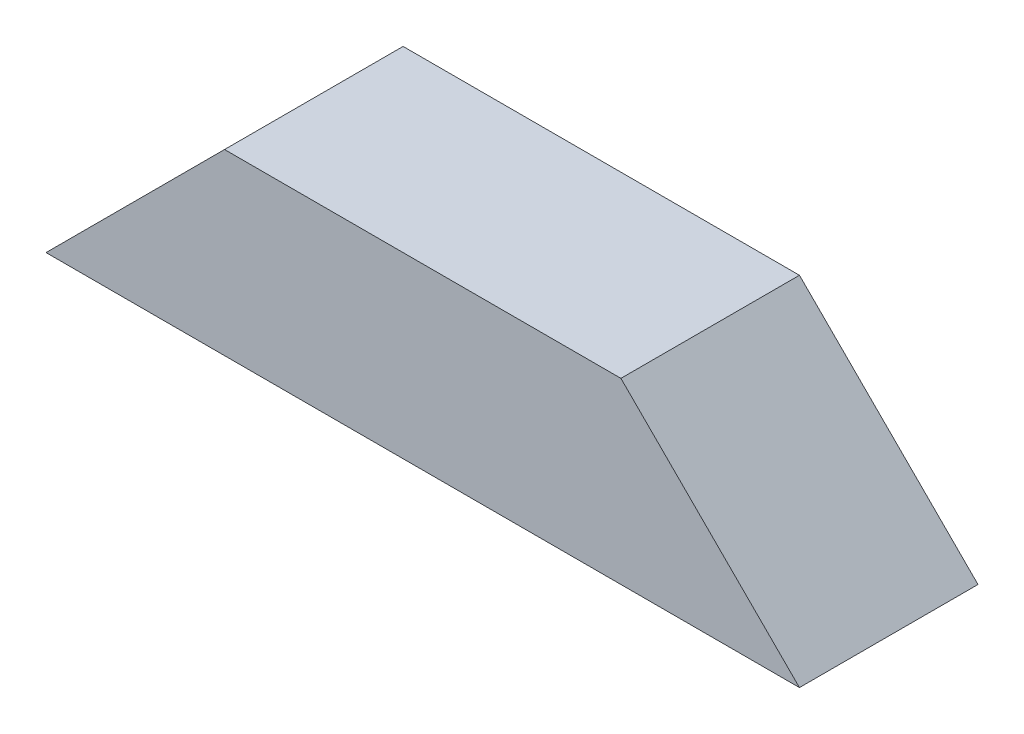
ISO-10303-21;
HEADER;
FILE_DESCRIPTION(('STEP AP214'),'2;1');
FILE_NAME('part.step','',(''),(''),'','','');
FILE_SCHEMA(('AUTOMOTIVE_DESIGN { 1 0 10303 214 1 1 1 1 }'));
ENDSEC;
DATA;
#1=APPLICATION_CONTEXT('core data for automotive mechanical design processes');
#2=APPLICATION_PROTOCOL_DEFINITION('international standard','automotive_design',2000,#1);
#3=PRODUCT_CONTEXT('',#1,'mechanical');
#4=PRODUCT('Part','Part','',(#3));
#5=PRODUCT_RELATED_PRODUCT_CATEGORY('part','',(#4));
#6=PRODUCT_DEFINITION_FORMATION('','',#4);
#7=PRODUCT_DEFINITION_CONTEXT('part definition',#1,'design');
#8=PRODUCT_DEFINITION('design','',#6,#7);
#9=PRODUCT_DEFINITION_SHAPE('','',#8);
#10=(LENGTH_UNIT() NAMED_UNIT(*) SI_UNIT(.MILLI.,.METRE.));
#11=(NAMED_UNIT(*) PLANE_ANGLE_UNIT() SI_UNIT($,.RADIAN.));
#12=(NAMED_UNIT(*) SI_UNIT($,.STERADIAN.) SOLID_ANGLE_UNIT());
#13=UNCERTAINTY_MEASURE_WITH_UNIT(LENGTH_MEASURE(1.E-05),#10,'distance_accuracy_value','');
#14=(GEOMETRIC_REPRESENTATION_CONTEXT(3) GLOBAL_UNCERTAINTY_ASSIGNED_CONTEXT((#13)) GLOBAL_UNIT_ASSIGNED_CONTEXT((#10,
#11,#12)) REPRESENTATION_CONTEXT('',''));
#15=CARTESIAN_POINT('',(0.,0.,0.));
#16=DIRECTION('',(0.,0.,1.));
#17=DIRECTION('',(1.,0.,0.));
#18=AXIS2_PLACEMENT_3D('',#15,#16,#17);
#19=CARTESIAN_POINT('',(19.2217669008793,24.9610519094172,5.));
#20=DIRECTION('',(0.707106781186548,-0.707106781186547,0.));
#21=DIRECTION('',(0.707106781186547,0.707106781186548,0.));
#22=AXIS2_PLACEMENT_3D('',#19,#20,#21);
#23=PLANE('',#22);
#24=DIRECTION('',(-0.707106781186547,-0.707106781186548,0.));
#25=VECTOR('',#24,1.);
#26=CARTESIAN_POINT('',(19.2217669008793,24.9610519094172,0.));
#27=LINE('',#26,#25);
#28=CARTESIAN_POINT('',(24.2217669008793,29.9610519094172,0.));
#29=VERTEX_POINT('',#28);
#30=CARTESIAN_POINT('',(19.2217669008793,24.9610519094172,0.));
#31=VERTEX_POINT('',#30);
#32=EDGE_CURVE('E98',#29,#31,#27,.T.);
#33=ORIENTED_EDGE('',*,*,#32,.T.);
#34=DIRECTION('',(0.,0.,-1.));
#35=VECTOR('',#34,1.);
#36=CARTESIAN_POINT('',(19.2217669008793,24.9610519094172,5.));
#37=LINE('',#36,#35);
#38=CARTESIAN_POINT('',(19.2217669008793,24.9610519094172,5.));
#39=VERTEX_POINT('',#38);
#40=EDGE_CURVE('E11',#39,#31,#37,.T.);
#41=ORIENTED_EDGE('',*,*,#40,.F.);
#42=DIRECTION('',(-0.707106781186547,-0.707106781186548,0.));
#43=VECTOR('',#42,1.);
#44=CARTESIAN_POINT('',(19.2217669008793,24.9610519094172,5.));
#45=LINE('',#44,#43);
#46=CARTESIAN_POINT('',(24.2217669008793,29.9610519094172,5.));
#47=VERTEX_POINT('',#46);
#48=EDGE_CURVE('E86',#47,#39,#45,.T.);
#49=ORIENTED_EDGE('',*,*,#48,.F.);
#50=DIRECTION('',(0.,0.,-1.));
#51=VECTOR('',#50,1.);
#52=CARTESIAN_POINT('',(24.2217669008793,29.9610519094172,5.));
#53=LINE('',#52,#51);
#54=EDGE_CURVE('E94',#47,#29,#53,.T.);
#55=ORIENTED_EDGE('',*,*,#54,.T.);
#56=EDGE_LOOP('',(#33,#41,#49,#55));
#57=FACE_BOUND('',#56,.T.);
#58=ADVANCED_FACE('F35',(#57),#23,.F.);
#59=CARTESIAN_POINT('',(19.2217669008793,24.9610519094172,5.));
#60=DIRECTION('',(0.,1.,0.));
#61=DIRECTION('',(0.,0.,1.));
#62=AXIS2_PLACEMENT_3D('',#59,#60,#61);
#63=PLANE('',#62);
#64=DIRECTION('',(1.,0.,0.));
#65=VECTOR('',#64,1.);
#66=CARTESIAN_POINT('',(19.2217669008793,24.9610519094172,0.));
#67=LINE('',#66,#65);
#68=CARTESIAN_POINT('',(40.3217669008793,24.9610519094172,0.));
#69=VERTEX_POINT('',#68);
#70=EDGE_CURVE('E90',#31,#69,#67,.T.);
#71=ORIENTED_EDGE('',*,*,#70,.T.);
#72=DIRECTION('',(0.,0.,-1.));
#73=VECTOR('',#72,1.);
#74=CARTESIAN_POINT('',(40.3217669008793,24.9610519094172,5.));
#75=LINE('',#74,#73);
#76=CARTESIAN_POINT('',(40.3217669008793,24.9610519094172,5.));
#77=VERTEX_POINT('',#76);
#78=EDGE_CURVE('E43',#77,#69,#75,.T.);
#79=ORIENTED_EDGE('',*,*,#78,.F.);
#80=DIRECTION('',(1.,0.,0.));
#81=VECTOR('',#80,1.);
#82=CARTESIAN_POINT('',(19.2217669008793,24.9610519094172,5.));
#83=LINE('',#82,#81);
#84=EDGE_CURVE('E81',#39,#77,#83,.T.);
#85=ORIENTED_EDGE('',*,*,#84,.F.);
#86=ORIENTED_EDGE('',*,*,#40,.T.);
#87=EDGE_LOOP('',(#71,#79,#85,#86));
#88=FACE_BOUND('',#87,.T.);
#89=ADVANCED_FACE('F89',(#88),#63,.F.);
#90=CARTESIAN_POINT('',(40.3217669008793,24.9610519094172,5.));
#91=DIRECTION('',(-0.707106781186541,-0.707106781186554,0.));
#92=DIRECTION('',(0.707106781186554,-0.707106781186541,0.));
#93=AXIS2_PLACEMENT_3D('',#90,#91,#92);
#94=PLANE('',#93);
#95=DIRECTION('',(-0.707106781186554,0.707106781186541,0.));
#96=VECTOR('',#95,1.);
#97=CARTESIAN_POINT('',(40.3217669008793,24.9610519094172,0.));
#98=LINE('',#97,#96);
#99=CARTESIAN_POINT('',(35.3217669008792,29.9610519094172,0.));
#100=VERTEX_POINT('',#99);
#101=EDGE_CURVE('E68',#69,#100,#98,.T.);
#102=ORIENTED_EDGE('',*,*,#101,.T.);
#103=DIRECTION('',(0.,0.,-1.));
#104=VECTOR('',#103,1.);
#105=CARTESIAN_POINT('',(35.3217669008792,29.9610519094172,5.));
#106=LINE('',#105,#104);
#107=CARTESIAN_POINT('',(35.3217669008792,29.9610519094172,5.));
#108=VERTEX_POINT('',#107);
#109=EDGE_CURVE('E91',#108,#100,#106,.T.);
#110=ORIENTED_EDGE('',*,*,#109,.F.);
#111=DIRECTION('',(-0.707106781186554,0.707106781186541,0.));
#112=VECTOR('',#111,1.);
#113=CARTESIAN_POINT('',(40.3217669008793,24.9610519094172,5.));
#114=LINE('',#113,#112);
#115=EDGE_CURVE('E84',#77,#108,#114,.T.);
#116=ORIENTED_EDGE('',*,*,#115,.F.);
#117=ORIENTED_EDGE('',*,*,#78,.T.);
#118=EDGE_LOOP('',(#102,#110,#116,#117));
#119=FACE_BOUND('',#118,.T.);
#120=ADVANCED_FACE('F92',(#119),#94,.F.);
#121=CARTESIAN_POINT('',(24.2217669008793,29.9610519094172,5.));
#122=DIRECTION('',(0.,-1.,0.));
#123=DIRECTION('',(0.,0.,-1.));
#124=AXIS2_PLACEMENT_3D('',#121,#122,#123);
#125=PLANE('',#124);
#126=DIRECTION('',(-1.,0.,0.));
#127=VECTOR('',#126,1.);
#128=CARTESIAN_POINT('',(24.2217669008793,29.9610519094172,0.));
#129=LINE('',#128,#127);
#130=EDGE_CURVE('E74',#100,#29,#129,.T.);
#131=ORIENTED_EDGE('',*,*,#130,.T.);
#132=ORIENTED_EDGE('',*,*,#54,.F.);
#133=DIRECTION('',(-1.,0.,0.));
#134=VECTOR('',#133,1.);
#135=CARTESIAN_POINT('',(24.2217669008793,29.9610519094172,5.));
#136=LINE('',#135,#134);
#137=EDGE_CURVE('E51',#108,#47,#136,.T.);
#138=ORIENTED_EDGE('',*,*,#137,.F.);
#139=ORIENTED_EDGE('',*,*,#109,.T.);
#140=EDGE_LOOP('',(#131,#132,#138,#139));
#141=FACE_BOUND('',#140,.T.);
#142=ADVANCED_FACE('F105',(#141),#125,.F.);
#143=CARTESIAN_POINT('',(0.,0.,5.));
#144=DIRECTION('',(0.,0.,1.));
#145=DIRECTION('',(1.,0.,0.));
#146=AXIS2_PLACEMENT_3D('',#143,#144,#145);
#147=PLANE('',#146);
#148=ORIENTED_EDGE('',*,*,#48,.T.);
#149=ORIENTED_EDGE('',*,*,#84,.T.);
#150=ORIENTED_EDGE('',*,*,#115,.T.);
#151=ORIENTED_EDGE('',*,*,#137,.T.);
#152=EDGE_LOOP('',(#148,#149,#150,#151));
#153=FACE_BOUND('',#152,.T.);
#154=ADVANCED_FACE('F82',(#153),#147,.T.);
#155=CARTESIAN_POINT('',(0.,0.,0.));
#156=DIRECTION('',(0.,0.,1.));
#157=DIRECTION('',(1.,0.,0.));
#158=AXIS2_PLACEMENT_3D('',#155,#156,#157);
#159=PLANE('',#158);
#160=ORIENTED_EDGE('',*,*,#32,.F.);
#161=ORIENTED_EDGE('',*,*,#130,.F.);
#162=ORIENTED_EDGE('',*,*,#101,.F.);
#163=ORIENTED_EDGE('',*,*,#70,.F.);
#164=EDGE_LOOP('',(#160,#161,#162,#163));
#165=FACE_BOUND('',#164,.T.);
#166=ADVANCED_FACE('F108',(#165),#159,.F.);
#167=CLOSED_SHELL('',(#58,#89,#120,#142,#154,#166));
#168=MANIFOLD_SOLID_BREP('B2',#167);
#169=ADVANCED_BREP_SHAPE_REPRESENTATION('',(#18,#168),#14);
#170=SHAPE_DEFINITION_REPRESENTATION(#9,#169);
ENDSEC;
END-ISO-10303-21;
